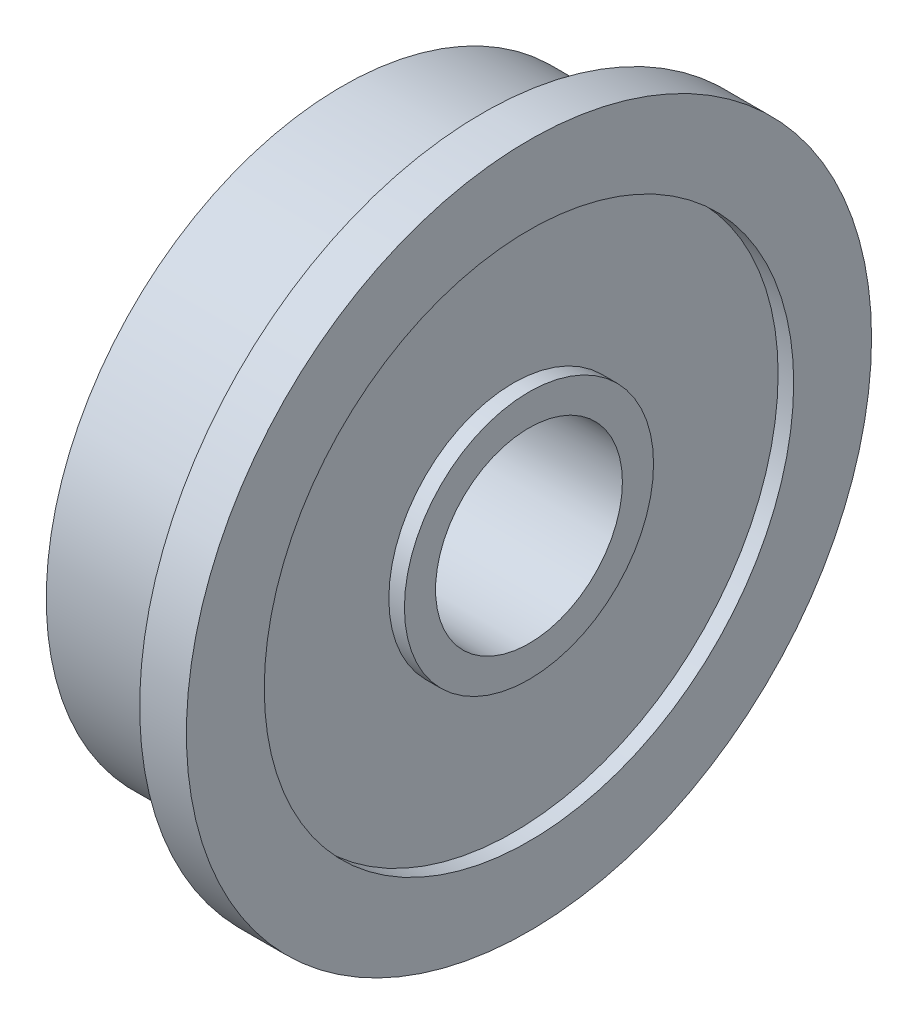
ISO-10303-21;
HEADER;
FILE_DESCRIPTION(('STEP AP214'),'2;1');
FILE_NAME('part.step','',(''),(''),'','','');
FILE_SCHEMA(('AUTOMOTIVE_DESIGN { 1 0 10303 214 1 1 1 1 }'));
ENDSEC;
DATA;
#1=APPLICATION_CONTEXT('core data for automotive mechanical design processes');
#2=APPLICATION_PROTOCOL_DEFINITION('international standard','automotive_design',2000,#1);
#3=PRODUCT_CONTEXT('',#1,'mechanical');
#4=PRODUCT('Part','Part','',(#3));
#5=PRODUCT_RELATED_PRODUCT_CATEGORY('part','',(#4));
#6=PRODUCT_DEFINITION_FORMATION('','',#4);
#7=PRODUCT_DEFINITION_CONTEXT('part definition',#1,'design');
#8=PRODUCT_DEFINITION('design','',#6,#7);
#9=PRODUCT_DEFINITION_SHAPE('','',#8);
#10=(LENGTH_UNIT() NAMED_UNIT(*) SI_UNIT(.MILLI.,.METRE.));
#11=(NAMED_UNIT(*) PLANE_ANGLE_UNIT() SI_UNIT($,.RADIAN.));
#12=(NAMED_UNIT(*) SI_UNIT($,.STERADIAN.) SOLID_ANGLE_UNIT());
#13=UNCERTAINTY_MEASURE_WITH_UNIT(LENGTH_MEASURE(1.E-05),#10,'distance_accuracy_value','');
#14=(GEOMETRIC_REPRESENTATION_CONTEXT(3) GLOBAL_UNCERTAINTY_ASSIGNED_CONTEXT((#13)) GLOBAL_UNIT_ASSIGNED_CONTEXT((#10,
#11,#12)) REPRESENTATION_CONTEXT('',''));
#15=CARTESIAN_POINT('',(0.,0.,0.));
#16=DIRECTION('',(0.,0.,1.));
#17=DIRECTION('',(1.,0.,0.));
#18=AXIS2_PLACEMENT_3D('',#15,#16,#17);
#19=CARTESIAN_POINT('',(-4.5,4.,0.));
#20=DIRECTION('',(-1.,0.,0.));
#21=DIRECTION('',(0.,0.,1.));
#22=AXIS2_PLACEMENT_3D('',#19,#20,#21);
#23=PLANE('',#22);
#24=CARTESIAN_POINT('',(-4.5,0.,0.));
#25=DIRECTION('',(1.,0.,0.));
#26=DIRECTION('',(0.,0.,-1.));
#27=AXIS2_PLACEMENT_3D('',#24,#25,#26);
#28=CIRCLE('',#27,3.);
#29=CARTESIAN_POINT('',(-4.5,0.,-3.));
#30=VERTEX_POINT('',#29);
#31=EDGE_CURVE('E10',#30,#30,#28,.T.);
#32=ORIENTED_EDGE('',*,*,#31,.T.);
#33=EDGE_LOOP('',(#32));
#34=FACE_BOUND('',#33,.T.);
#35=CARTESIAN_POINT('',(-4.5,0.,0.));
#36=DIRECTION('',(1.,0.,0.));
#37=DIRECTION('',(0.,0.,-1.));
#38=AXIS2_PLACEMENT_3D('',#35,#36,#37);
#39=CIRCLE('',#38,4.);
#40=CARTESIAN_POINT('',(-4.5,0.,-4.));
#41=VERTEX_POINT('',#40);
#42=EDGE_CURVE('E75',#41,#41,#39,.T.);
#43=ORIENTED_EDGE('',*,*,#42,.F.);
#44=EDGE_LOOP('',(#43));
#45=FACE_BOUND('',#44,.T.);
#46=ADVANCED_FACE('F29',(#34,#45),#23,.T.);
#47=CARTESIAN_POINT('',(0.,0.,0.));
#48=DIRECTION('',(1.,0.,0.));
#49=DIRECTION('',(0.,0.,-1.));
#50=AXIS2_PLACEMENT_3D('',#47,#48,#49);
#51=CYLINDRICAL_SURFACE('',#50,3.);
#52=CARTESIAN_POINT('',(1.5,0.,0.));
#53=DIRECTION('',(1.,0.,0.));
#54=DIRECTION('',(0.,0.,-1.));
#55=AXIS2_PLACEMENT_3D('',#52,#53,#54);
#56=CIRCLE('',#55,3.);
#57=CARTESIAN_POINT('',(1.5,0.,-3.));
#58=VERTEX_POINT('',#57);
#59=EDGE_CURVE('E35',#58,#58,#56,.T.);
#60=ORIENTED_EDGE('',*,*,#59,.T.);
#61=EDGE_LOOP('',(#60));
#62=FACE_BOUND('',#61,.T.);
#63=ORIENTED_EDGE('',*,*,#31,.F.);
#64=EDGE_LOOP('',(#63));
#65=FACE_BOUND('',#64,.T.);
#66=ADVANCED_FACE('F83',(#62,#65),#51,.F.);
#67=CARTESIAN_POINT('',(1.5,3.,0.));
#68=DIRECTION('',(1.,0.,0.));
#69=DIRECTION('',(0.,0.,-1.));
#70=AXIS2_PLACEMENT_3D('',#67,#68,#69);
#71=PLANE('',#70);
#72=CARTESIAN_POINT('',(1.5,0.,0.));
#73=DIRECTION('',(1.,0.,0.));
#74=DIRECTION('',(0.,0.,-1.));
#75=AXIS2_PLACEMENT_3D('',#72,#73,#74);
#76=CIRCLE('',#75,4.);
#77=CARTESIAN_POINT('',(1.5,0.,-4.));
#78=VERTEX_POINT('',#77);
#79=EDGE_CURVE('E39',#78,#78,#76,.T.);
#80=ORIENTED_EDGE('',*,*,#79,.T.);
#81=EDGE_LOOP('',(#80));
#82=FACE_BOUND('',#81,.T.);
#83=ORIENTED_EDGE('',*,*,#59,.F.);
#84=EDGE_LOOP('',(#83));
#85=FACE_BOUND('',#84,.T.);
#86=ADVANCED_FACE('F87',(#82,#85),#71,.T.);
#87=CARTESIAN_POINT('',(0.,0.,0.));
#88=DIRECTION('',(1.,0.,0.));
#89=DIRECTION('',(0.,0.,-1.));
#90=AXIS2_PLACEMENT_3D('',#87,#88,#89);
#91=CYLINDRICAL_SURFACE('',#90,4.);
#92=CARTESIAN_POINT('',(1.,0.,0.));
#93=DIRECTION('',(1.,0.,0.));
#94=DIRECTION('',(0.,0.,-1.));
#95=AXIS2_PLACEMENT_3D('',#92,#93,#94);
#96=CIRCLE('',#95,4.);
#97=CARTESIAN_POINT('',(1.,0.,-4.));
#98=VERTEX_POINT('',#97);
#99=EDGE_CURVE('E43',#98,#98,#96,.T.);
#100=ORIENTED_EDGE('',*,*,#99,.T.);
#101=EDGE_LOOP('',(#100));
#102=FACE_BOUND('',#101,.T.);
#103=ORIENTED_EDGE('',*,*,#79,.F.);
#104=EDGE_LOOP('',(#103));
#105=FACE_BOUND('',#104,.T.);
#106=ADVANCED_FACE('F91',(#102,#105),#91,.T.);
#107=CARTESIAN_POINT('',(1.,8.5,0.));
#108=DIRECTION('',(1.,0.,0.));
#109=DIRECTION('',(0.,0.,-1.));
#110=AXIS2_PLACEMENT_3D('',#107,#108,#109);
#111=PLANE('',#110);
#112=CARTESIAN_POINT('',(1.,0.,0.));
#113=DIRECTION('',(1.,0.,0.));
#114=DIRECTION('',(0.,0.,-1.));
#115=AXIS2_PLACEMENT_3D('',#112,#113,#114);
#116=CIRCLE('',#115,8.5);
#117=CARTESIAN_POINT('',(1.,0.,-8.5));
#118=VERTEX_POINT('',#117);
#119=EDGE_CURVE('E48',#118,#118,#116,.T.);
#120=ORIENTED_EDGE('',*,*,#119,.T.);
#121=EDGE_LOOP('',(#120));
#122=FACE_BOUND('',#121,.T.);
#123=ORIENTED_EDGE('',*,*,#99,.F.);
#124=EDGE_LOOP('',(#123));
#125=FACE_BOUND('',#124,.T.);
#126=ADVANCED_FACE('F98',(#122,#125),#111,.T.);
#127=CARTESIAN_POINT('',(0.,0.,0.));
#128=DIRECTION('',(1.,0.,0.));
#129=DIRECTION('',(0.,0.,-1.));
#130=AXIS2_PLACEMENT_3D('',#127,#128,#129);
#131=CYLINDRICAL_SURFACE('',#130,8.5);
#132=CARTESIAN_POINT('',(1.5,0.,0.));
#133=DIRECTION('',(1.,0.,0.));
#134=DIRECTION('',(0.,0.,-1.));
#135=AXIS2_PLACEMENT_3D('',#132,#133,#134);
#136=CIRCLE('',#135,8.5);
#137=CARTESIAN_POINT('',(1.5,0.,-8.5));
#138=VERTEX_POINT('',#137);
#139=EDGE_CURVE('E51',#138,#138,#136,.T.);
#140=ORIENTED_EDGE('',*,*,#139,.T.);
#141=EDGE_LOOP('',(#140));
#142=FACE_BOUND('',#141,.T.);
#143=ORIENTED_EDGE('',*,*,#119,.F.);
#144=EDGE_LOOP('',(#143));
#145=FACE_BOUND('',#144,.T.);
#146=ADVANCED_FACE('F102',(#142,#145),#131,.F.);
#147=CARTESIAN_POINT('',(1.5,8.5,0.));
#148=DIRECTION('',(1.,0.,0.));
#149=DIRECTION('',(0.,0.,-1.));
#150=AXIS2_PLACEMENT_3D('',#147,#148,#149);
#151=PLANE('',#150);
#152=CARTESIAN_POINT('',(1.5,0.,0.));
#153=DIRECTION('',(1.,0.,0.));
#154=DIRECTION('',(0.,0.,-1.));
#155=AXIS2_PLACEMENT_3D('',#152,#153,#154);
#156=CIRCLE('',#155,11.);
#157=CARTESIAN_POINT('',(1.5,0.,-11.));
#158=VERTEX_POINT('',#157);
#159=EDGE_CURVE('E54',#158,#158,#156,.T.);
#160=ORIENTED_EDGE('',*,*,#159,.T.);
#161=EDGE_LOOP('',(#160));
#162=FACE_BOUND('',#161,.T.);
#163=ORIENTED_EDGE('',*,*,#139,.F.);
#164=EDGE_LOOP('',(#163));
#165=FACE_BOUND('',#164,.T.);
#166=ADVANCED_FACE('F106',(#162,#165),#151,.T.);
#167=CARTESIAN_POINT('',(0.,0.,0.));
#168=DIRECTION('',(1.,0.,0.));
#169=DIRECTION('',(0.,0.,-1.));
#170=AXIS2_PLACEMENT_3D('',#167,#168,#169);
#171=CYLINDRICAL_SURFACE('',#170,11.);
#172=CARTESIAN_POINT('',(0.,0.,0.));
#173=DIRECTION('',(1.,0.,0.));
#174=DIRECTION('',(0.,0.,-1.));
#175=AXIS2_PLACEMENT_3D('',#172,#173,#174);
#176=CIRCLE('',#175,11.);
#177=CARTESIAN_POINT('',(0.,0.,-11.));
#178=VERTEX_POINT('',#177);
#179=EDGE_CURVE('E57',#178,#178,#176,.T.);
#180=ORIENTED_EDGE('',*,*,#179,.T.);
#181=EDGE_LOOP('',(#180));
#182=FACE_BOUND('',#181,.T.);
#183=ORIENTED_EDGE('',*,*,#159,.F.);
#184=EDGE_LOOP('',(#183));
#185=FACE_BOUND('',#184,.T.);
#186=ADVANCED_FACE('F110',(#182,#185),#171,.T.);
#187=CARTESIAN_POINT('',(0.,11.,0.));
#188=DIRECTION('',(-1.,0.,0.));
#189=DIRECTION('',(0.,0.,1.));
#190=AXIS2_PLACEMENT_3D('',#187,#188,#189);
#191=PLANE('',#190);
#192=CARTESIAN_POINT('',(0.,0.,0.));
#193=DIRECTION('',(1.,0.,0.));
#194=DIRECTION('',(0.,0.,-1.));
#195=AXIS2_PLACEMENT_3D('',#192,#193,#194);
#196=CIRCLE('',#195,9.5);
#197=CARTESIAN_POINT('',(0.,0.,-9.5));
#198=VERTEX_POINT('',#197);
#199=EDGE_CURVE('E60',#198,#198,#196,.T.);
#200=ORIENTED_EDGE('',*,*,#199,.T.);
#201=EDGE_LOOP('',(#200));
#202=FACE_BOUND('',#201,.T.);
#203=ORIENTED_EDGE('',*,*,#179,.F.);
#204=EDGE_LOOP('',(#203));
#205=FACE_BOUND('',#204,.T.);
#206=ADVANCED_FACE('F114',(#202,#205),#191,.T.);
#207=CARTESIAN_POINT('',(0.,0.,0.));
#208=DIRECTION('',(1.,0.,0.));
#209=DIRECTION('',(0.,0.,-1.));
#210=AXIS2_PLACEMENT_3D('',#207,#208,#209);
#211=CYLINDRICAL_SURFACE('',#210,9.5);
#212=CARTESIAN_POINT('',(-4.5,0.,0.));
#213=DIRECTION('',(1.,0.,0.));
#214=DIRECTION('',(0.,0.,-1.));
#215=AXIS2_PLACEMENT_3D('',#212,#213,#214);
#216=CIRCLE('',#215,9.5);
#217=CARTESIAN_POINT('',(-4.5,0.,-9.5));
#218=VERTEX_POINT('',#217);
#219=EDGE_CURVE('E63',#218,#218,#216,.T.);
#220=ORIENTED_EDGE('',*,*,#219,.T.);
#221=EDGE_LOOP('',(#220));
#222=FACE_BOUND('',#221,.T.);
#223=ORIENTED_EDGE('',*,*,#199,.F.);
#224=EDGE_LOOP('',(#223));
#225=FACE_BOUND('',#224,.T.);
#226=ADVANCED_FACE('F118',(#222,#225),#211,.T.);
#227=CARTESIAN_POINT('',(-4.5,9.5,0.));
#228=DIRECTION('',(-1.,0.,0.));
#229=DIRECTION('',(0.,0.,1.));
#230=AXIS2_PLACEMENT_3D('',#227,#228,#229);
#231=PLANE('',#230);
#232=CARTESIAN_POINT('',(-4.5,0.,0.));
#233=DIRECTION('',(1.,0.,0.));
#234=DIRECTION('',(0.,0.,-1.));
#235=AXIS2_PLACEMENT_3D('',#232,#233,#234);
#236=CIRCLE('',#235,8.5);
#237=CARTESIAN_POINT('',(-4.5,0.,-8.5));
#238=VERTEX_POINT('',#237);
#239=EDGE_CURVE('E66',#238,#238,#236,.T.);
#240=ORIENTED_EDGE('',*,*,#239,.T.);
#241=EDGE_LOOP('',(#240));
#242=FACE_BOUND('',#241,.T.);
#243=ORIENTED_EDGE('',*,*,#219,.F.);
#244=EDGE_LOOP('',(#243));
#245=FACE_BOUND('',#244,.T.);
#246=ADVANCED_FACE('F122',(#242,#245),#231,.T.);
#247=CARTESIAN_POINT('',(0.,0.,0.));
#248=DIRECTION('',(1.,0.,0.));
#249=DIRECTION('',(0.,0.,-1.));
#250=AXIS2_PLACEMENT_3D('',#247,#248,#249);
#251=CYLINDRICAL_SURFACE('',#250,8.5);
#252=CARTESIAN_POINT('',(-4.,0.,0.));
#253=DIRECTION('',(1.,0.,0.));
#254=DIRECTION('',(0.,0.,-1.));
#255=AXIS2_PLACEMENT_3D('',#252,#253,#254);
#256=CIRCLE('',#255,8.5);
#257=CARTESIAN_POINT('',(-4.,0.,-8.5));
#258=VERTEX_POINT('',#257);
#259=EDGE_CURVE('E69',#258,#258,#256,.T.);
#260=ORIENTED_EDGE('',*,*,#259,.T.);
#261=EDGE_LOOP('',(#260));
#262=FACE_BOUND('',#261,.T.);
#263=ORIENTED_EDGE('',*,*,#239,.F.);
#264=EDGE_LOOP('',(#263));
#265=FACE_BOUND('',#264,.T.);
#266=ADVANCED_FACE('F126',(#262,#265),#251,.F.);
#267=CARTESIAN_POINT('',(-4.,8.5,0.));
#268=DIRECTION('',(-1.,0.,0.));
#269=DIRECTION('',(0.,0.,1.));
#270=AXIS2_PLACEMENT_3D('',#267,#268,#269);
#271=PLANE('',#270);
#272=CARTESIAN_POINT('',(-4.,0.,0.));
#273=DIRECTION('',(1.,0.,0.));
#274=DIRECTION('',(0.,0.,-1.));
#275=AXIS2_PLACEMENT_3D('',#272,#273,#274);
#276=CIRCLE('',#275,4.);
#277=CARTESIAN_POINT('',(-4.,0.,-4.));
#278=VERTEX_POINT('',#277);
#279=EDGE_CURVE('E72',#278,#278,#276,.T.);
#280=ORIENTED_EDGE('',*,*,#279,.T.);
#281=EDGE_LOOP('',(#280));
#282=FACE_BOUND('',#281,.T.);
#283=ORIENTED_EDGE('',*,*,#259,.F.);
#284=EDGE_LOOP('',(#283));
#285=FACE_BOUND('',#284,.T.);
#286=ADVANCED_FACE('F130',(#282,#285),#271,.T.);
#287=CARTESIAN_POINT('',(0.,0.,0.));
#288=DIRECTION('',(1.,0.,0.));
#289=DIRECTION('',(0.,0.,-1.));
#290=AXIS2_PLACEMENT_3D('',#287,#288,#289);
#291=CYLINDRICAL_SURFACE('',#290,4.);
#292=ORIENTED_EDGE('',*,*,#42,.T.);
#293=EDGE_LOOP('',(#292));
#294=FACE_BOUND('',#293,.T.);
#295=ORIENTED_EDGE('',*,*,#279,.F.);
#296=EDGE_LOOP('',(#295));
#297=FACE_BOUND('',#296,.T.);
#298=ADVANCED_FACE('F79',(#294,#297),#291,.T.);
#299=CLOSED_SHELL('',(#46,#66,#86,#106,#126,#146,#166,#186,#206,#226,#246,#266,#286,#298));
#300=MANIFOLD_SOLID_BREP('B2',#299);
#301=ADVANCED_BREP_SHAPE_REPRESENTATION('',(#18,#300),#14);
#302=SHAPE_DEFINITION_REPRESENTATION(#9,#301);
ENDSEC;
END-ISO-10303-21;
